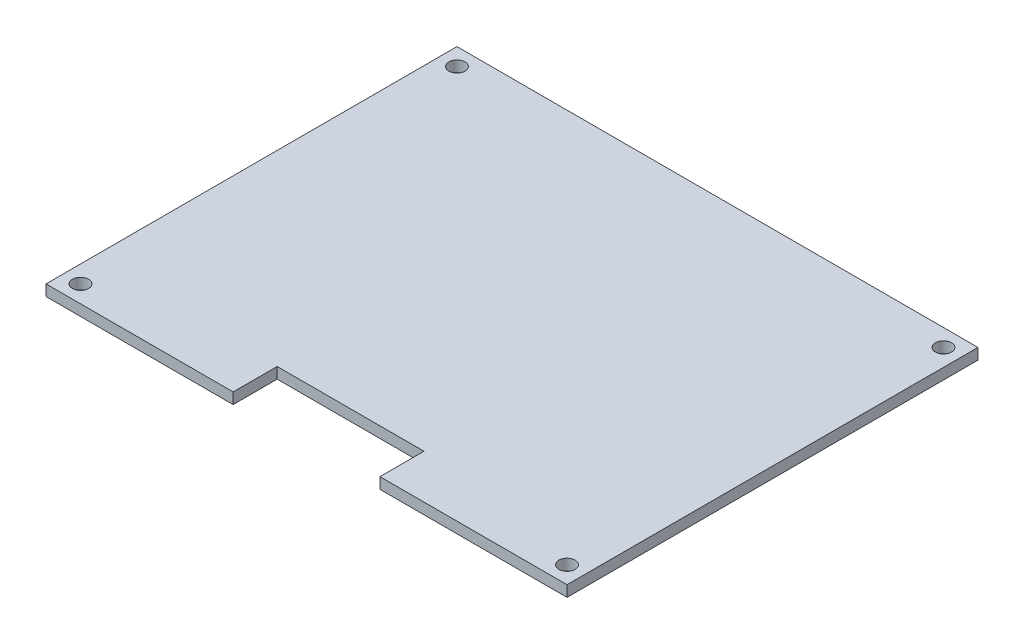
ISO-10303-21;
HEADER;
FILE_DESCRIPTION(('STEP AP214'),'2;1');
FILE_NAME('part.step','',(''),(''),'','','');
FILE_SCHEMA(('AUTOMOTIVE_DESIGN { 1 0 10303 214 1 1 1 1 }'));
ENDSEC;
DATA;
#1=APPLICATION_CONTEXT('core data for automotive mechanical design processes');
#2=APPLICATION_PROTOCOL_DEFINITION('international standard','automotive_design',2000,#1);
#3=PRODUCT_CONTEXT('',#1,'mechanical');
#4=PRODUCT('Part','Part','',(#3));
#5=PRODUCT_RELATED_PRODUCT_CATEGORY('part','',(#4));
#6=PRODUCT_DEFINITION_FORMATION('','',#4);
#7=PRODUCT_DEFINITION_CONTEXT('part definition',#1,'design');
#8=PRODUCT_DEFINITION('design','',#6,#7);
#9=PRODUCT_DEFINITION_SHAPE('','',#8);
#10=(LENGTH_UNIT() NAMED_UNIT(*) SI_UNIT(.MILLI.,.METRE.));
#11=(NAMED_UNIT(*) PLANE_ANGLE_UNIT() SI_UNIT($,.RADIAN.));
#12=(NAMED_UNIT(*) SI_UNIT($,.STERADIAN.) SOLID_ANGLE_UNIT());
#13=UNCERTAINTY_MEASURE_WITH_UNIT(LENGTH_MEASURE(1.E-05),#10,'distance_accuracy_value','');
#14=(GEOMETRIC_REPRESENTATION_CONTEXT(3) GLOBAL_UNCERTAINTY_ASSIGNED_CONTEXT((#13)) GLOBAL_UNIT_ASSIGNED_CONTEXT((#10,
#11,#12)) REPRESENTATION_CONTEXT('',''));
#15=CARTESIAN_POINT('',(0.,0.,0.));
#16=DIRECTION('',(0.,0.,1.));
#17=DIRECTION('',(1.,0.,0.));
#18=AXIS2_PLACEMENT_3D('',#15,#16,#17);
#19=CARTESIAN_POINT('',(0.,1.5,0.));
#20=DIRECTION('',(0.,0.,-1.));
#21=DIRECTION('',(-1.,0.,0.));
#22=AXIS2_PLACEMENT_3D('',#19,#20,#21);
#23=PLANE('',#22);
#24=DIRECTION('',(1.,0.,0.));
#25=VECTOR('',#24,1.);
#26=CARTESIAN_POINT('',(0.,1.5,0.));
#27=LINE('',#26,#25);
#28=CARTESIAN_POINT('',(45.5,1.5,0.));
#29=VERTEX_POINT('',#28);
#30=CARTESIAN_POINT('',(71.,1.5,0.));
#31=VERTEX_POINT('',#30);
#32=EDGE_CURVE('E129',#29,#31,#27,.T.);
#33=ORIENTED_EDGE('',*,*,#32,.F.);
#34=DIRECTION('',(0.,1.,0.));
#35=VECTOR('',#34,1.);
#36=CARTESIAN_POINT('',(45.5,-20.8806130178211,0.));
#37=LINE('',#36,#35);
#38=CARTESIAN_POINT('',(45.5,0.,0.));
#39=VERTEX_POINT('',#38);
#40=EDGE_CURVE('E117',#39,#29,#37,.T.);
#41=ORIENTED_EDGE('',*,*,#40,.F.);
#42=DIRECTION('',(1.,0.,0.));
#43=VECTOR('',#42,1.);
#44=CARTESIAN_POINT('',(0.,0.,0.));
#45=LINE('',#44,#43);
#46=CARTESIAN_POINT('',(71.,0.,0.));
#47=VERTEX_POINT('',#46);
#48=EDGE_CURVE('E127',#39,#47,#45,.T.);
#49=ORIENTED_EDGE('',*,*,#48,.T.);
#50=DIRECTION('',(0.,-1.,0.));
#51=VECTOR('',#50,1.);
#52=CARTESIAN_POINT('',(71.,1.5,0.));
#53=LINE('',#52,#51);
#54=EDGE_CURVE('E47',#31,#47,#53,.T.);
#55=ORIENTED_EDGE('',*,*,#54,.F.);
#56=EDGE_LOOP('',(#33,#41,#49,#55));
#57=FACE_BOUND('',#56,.T.);
#58=ADVANCED_FACE('F39',(#57),#23,.F.);
#59=CARTESIAN_POINT('',(0.,1.5,0.));
#60=DIRECTION('',(1.,0.,0.));
#61=DIRECTION('',(0.,0.,-1.));
#62=AXIS2_PLACEMENT_3D('',#59,#60,#61);
#63=PLANE('',#62);
#64=DIRECTION('',(0.,0.,1.));
#65=VECTOR('',#64,1.);
#66=CARTESIAN_POINT('',(0.,0.,0.));
#67=LINE('',#66,#65);
#68=CARTESIAN_POINT('',(0.,0.,-56.));
#69=VERTEX_POINT('',#68);
#70=CARTESIAN_POINT('',(0.,0.,0.));
#71=VERTEX_POINT('',#70);
#72=EDGE_CURVE('E136',#69,#71,#67,.T.);
#73=ORIENTED_EDGE('',*,*,#72,.T.);
#74=DIRECTION('',(0.,-1.,0.));
#75=VECTOR('',#74,1.);
#76=CARTESIAN_POINT('',(0.,1.5,0.));
#77=LINE('',#76,#75);
#78=CARTESIAN_POINT('',(0.,1.5,0.));
#79=VERTEX_POINT('',#78);
#80=EDGE_CURVE('E11',#79,#71,#77,.T.);
#81=ORIENTED_EDGE('',*,*,#80,.F.);
#82=DIRECTION('',(0.,0.,1.));
#83=VECTOR('',#82,1.);
#84=CARTESIAN_POINT('',(0.,1.5,0.));
#85=LINE('',#84,#83);
#86=CARTESIAN_POINT('',(0.,1.5,-56.));
#87=VERTEX_POINT('',#86);
#88=EDGE_CURVE('E145',#87,#79,#85,.T.);
#89=ORIENTED_EDGE('',*,*,#88,.F.);
#90=DIRECTION('',(0.,-1.,0.));
#91=VECTOR('',#90,1.);
#92=CARTESIAN_POINT('',(0.,1.5,-56.));
#93=LINE('',#92,#91);
#94=EDGE_CURVE('E146',#87,#69,#93,.T.);
#95=ORIENTED_EDGE('',*,*,#94,.T.);
#96=EDGE_LOOP('',(#73,#81,#89,#95));
#97=FACE_BOUND('',#96,.T.);
#98=ADVANCED_FACE('F41',(#97),#63,.F.);
#99=CARTESIAN_POINT('',(25.5,0.,0.));
#100=VERTEX_POINT('',#99);
#101=EDGE_CURVE('E135',#71,#100,#45,.T.);
#102=ORIENTED_EDGE('',*,*,#101,.T.);
#103=DIRECTION('',(0.,1.,0.));
#104=VECTOR('',#103,1.);
#105=CARTESIAN_POINT('',(25.5,-20.8806130178211,0.));
#106=LINE('',#105,#104);
#107=CARTESIAN_POINT('',(25.5,1.5,0.));
#108=VERTEX_POINT('',#107);
#109=EDGE_CURVE('E54',#100,#108,#106,.T.);
#110=ORIENTED_EDGE('',*,*,#109,.T.);
#111=EDGE_CURVE('E90',#79,#108,#27,.T.);
#112=ORIENTED_EDGE('',*,*,#111,.F.);
#113=ORIENTED_EDGE('',*,*,#80,.T.);
#114=EDGE_LOOP('',(#102,#110,#112,#113));
#115=FACE_BOUND('',#114,.T.);
#116=ADVANCED_FACE('F231',(#115),#23,.F.);
#117=CARTESIAN_POINT('',(71.,1.5,0.));
#118=DIRECTION('',(-1.,0.,0.));
#119=DIRECTION('',(0.,0.,1.));
#120=AXIS2_PLACEMENT_3D('',#117,#118,#119);
#121=PLANE('',#120);
#122=DIRECTION('',(0.,0.,-1.));
#123=VECTOR('',#122,1.);
#124=CARTESIAN_POINT('',(71.,0.,0.));
#125=LINE('',#124,#123);
#126=CARTESIAN_POINT('',(71.,0.,-56.));
#127=VERTEX_POINT('',#126);
#128=EDGE_CURVE('E134',#47,#127,#125,.T.);
#129=ORIENTED_EDGE('',*,*,#128,.T.);
#130=DIRECTION('',(0.,-1.,0.));
#131=VECTOR('',#130,1.);
#132=CARTESIAN_POINT('',(71.,1.5,-56.));
#133=LINE('',#132,#131);
#134=CARTESIAN_POINT('',(71.,1.5,-56.));
#135=VERTEX_POINT('',#134);
#136=EDGE_CURVE('E148',#135,#127,#133,.T.);
#137=ORIENTED_EDGE('',*,*,#136,.F.);
#138=DIRECTION('',(0.,0.,-1.));
#139=VECTOR('',#138,1.);
#140=CARTESIAN_POINT('',(71.,1.5,0.));
#141=LINE('',#140,#139);
#142=EDGE_CURVE('E153',#31,#135,#141,.T.);
#143=ORIENTED_EDGE('',*,*,#142,.F.);
#144=ORIENTED_EDGE('',*,*,#54,.T.);
#145=EDGE_LOOP('',(#129,#137,#143,#144));
#146=FACE_BOUND('',#145,.T.);
#147=ADVANCED_FACE('F151',(#146),#121,.F.);
#148=CARTESIAN_POINT('',(0.,1.5,-56.));
#149=DIRECTION('',(0.,0.,1.));
#150=DIRECTION('',(1.,0.,0.));
#151=AXIS2_PLACEMENT_3D('',#148,#149,#150);
#152=PLANE('',#151);
#153=DIRECTION('',(-1.,0.,0.));
#154=VECTOR('',#153,1.);
#155=CARTESIAN_POINT('',(0.,0.,-56.));
#156=LINE('',#155,#154);
#157=EDGE_CURVE('E84',#127,#69,#156,.T.);
#158=ORIENTED_EDGE('',*,*,#157,.T.);
#159=ORIENTED_EDGE('',*,*,#94,.F.);
#160=DIRECTION('',(-1.,0.,0.));
#161=VECTOR('',#160,1.);
#162=CARTESIAN_POINT('',(0.,1.5,-56.));
#163=LINE('',#162,#161);
#164=EDGE_CURVE('E63',#135,#87,#163,.T.);
#165=ORIENTED_EDGE('',*,*,#164,.F.);
#166=ORIENTED_EDGE('',*,*,#136,.T.);
#167=EDGE_LOOP('',(#158,#159,#165,#166));
#168=FACE_BOUND('',#167,.T.);
#169=ADVANCED_FACE('F243',(#168),#152,.F.);
#170=CARTESIAN_POINT('',(0.,1.5,0.));
#171=DIRECTION('',(0.,-1.,0.));
#172=DIRECTION('',(0.,0.,-1.));
#173=AXIS2_PLACEMENT_3D('',#170,#171,#172);
#174=PLANE('',#173);
#175=CARTESIAN_POINT('',(2.34999999999999,1.5,-2.35));
#176=DIRECTION('',(0.,-1.,0.));
#177=DIRECTION('',(0.,0.,-1.));
#178=AXIS2_PLACEMENT_3D('',#175,#176,#177);
#179=CIRCLE('',#178,1.09999999999999);
#180=CARTESIAN_POINT('',(2.34999999999999,1.5,-3.45));
#181=VERTEX_POINT('',#180);
#182=EDGE_CURVE('E188',#181,#181,#179,.T.);
#183=ORIENTED_EDGE('',*,*,#182,.T.);
#184=EDGE_LOOP('',(#183));
#185=FACE_BOUND('',#184,.T.);
#186=CARTESIAN_POINT('',(68.65,1.5,-2.35));
#187=DIRECTION('',(0.,-1.,0.));
#188=DIRECTION('',(0.,0.,-1.));
#189=AXIS2_PLACEMENT_3D('',#186,#187,#188);
#190=CIRCLE('',#189,1.10000000000001);
#191=CARTESIAN_POINT('',(68.65,1.5,-3.45000000000001));
#192=VERTEX_POINT('',#191);
#193=EDGE_CURVE('E189',#192,#192,#190,.T.);
#194=ORIENTED_EDGE('',*,*,#193,.T.);
#195=EDGE_LOOP('',(#194));
#196=FACE_BOUND('',#195,.T.);
#197=CARTESIAN_POINT('',(2.34999999999999,1.5,-53.65));
#198=DIRECTION('',(0.,1.,0.));
#199=DIRECTION('',(0.,0.,1.));
#200=AXIS2_PLACEMENT_3D('',#197,#198,#199);
#201=CIRCLE('',#200,1.09999999999999);
#202=CARTESIAN_POINT('',(2.34999999999999,1.5,-52.55));
#203=VERTEX_POINT('',#202);
#204=EDGE_CURVE('E176',#203,#203,#201,.T.);
#205=ORIENTED_EDGE('',*,*,#204,.F.);
#206=EDGE_LOOP('',(#205));
#207=FACE_BOUND('',#206,.T.);
#208=CARTESIAN_POINT('',(68.65,1.5,-53.65));
#209=DIRECTION('',(0.,1.,0.));
#210=DIRECTION('',(0.,0.,1.));
#211=AXIS2_PLACEMENT_3D('',#208,#209,#210);
#212=CIRCLE('',#211,1.10000000000001);
#213=CARTESIAN_POINT('',(68.65,1.5,-52.55));
#214=VERTEX_POINT('',#213);
#215=EDGE_CURVE('E173',#214,#214,#212,.T.);
#216=ORIENTED_EDGE('',*,*,#215,.F.);
#217=EDGE_LOOP('',(#216));
#218=FACE_BOUND('',#217,.T.);
#219=DIRECTION('',(-1.,0.,0.));
#220=VECTOR('',#219,1.);
#221=CARTESIAN_POINT('',(25.5,1.5,-6.));
#222=LINE('',#221,#220);
#223=CARTESIAN_POINT('',(45.5,1.5,-6.));
#224=VERTEX_POINT('',#223);
#225=CARTESIAN_POINT('',(25.5,1.5,-6.));
#226=VERTEX_POINT('',#225);
#227=EDGE_CURVE('E130',#224,#226,#222,.T.);
#228=ORIENTED_EDGE('',*,*,#227,.F.);
#229=DIRECTION('',(0.,0.,-1.));
#230=VECTOR('',#229,1.);
#231=CARTESIAN_POINT('',(45.5,1.5,-6.));
#232=LINE('',#231,#230);
#233=EDGE_CURVE('E168',#29,#224,#232,.T.);
#234=ORIENTED_EDGE('',*,*,#233,.F.);
#235=ORIENTED_EDGE('',*,*,#32,.T.);
#236=ORIENTED_EDGE('',*,*,#142,.T.);
#237=ORIENTED_EDGE('',*,*,#164,.T.);
#238=ORIENTED_EDGE('',*,*,#88,.T.);
#239=ORIENTED_EDGE('',*,*,#111,.T.);
#240=DIRECTION('',(0.,0.,1.));
#241=VECTOR('',#240,1.);
#242=CARTESIAN_POINT('',(25.5,1.5,-6.));
#243=LINE('',#242,#241);
#244=EDGE_CURVE('E166',#226,#108,#243,.T.);
#245=ORIENTED_EDGE('',*,*,#244,.F.);
#246=EDGE_LOOP('',(#228,#234,#235,#236,#237,#238,#239,#245));
#247=FACE_BOUND('',#246,.T.);
#248=ADVANCED_FACE('F197',(#185,#196,#207,#218,#247),#174,.F.);
#249=CARTESIAN_POINT('',(0.,0.,0.));
#250=DIRECTION('',(0.,-1.,0.));
#251=DIRECTION('',(0.,0.,-1.));
#252=AXIS2_PLACEMENT_3D('',#249,#250,#251);
#253=PLANE('',#252);
#254=CARTESIAN_POINT('',(2.34999999999999,0.,-2.35));
#255=DIRECTION('',(0.,-1.,0.));
#256=DIRECTION('',(0.,0.,-1.));
#257=AXIS2_PLACEMENT_3D('',#254,#255,#256);
#258=CIRCLE('',#257,1.09999999999999);
#259=CARTESIAN_POINT('',(2.34999999999999,0.,-3.45));
#260=VERTEX_POINT('',#259);
#261=EDGE_CURVE('E180',#260,#260,#258,.T.);
#262=ORIENTED_EDGE('',*,*,#261,.F.);
#263=EDGE_LOOP('',(#262));
#264=FACE_BOUND('',#263,.T.);
#265=CARTESIAN_POINT('',(68.65,0.,-2.35));
#266=DIRECTION('',(0.,-1.,0.));
#267=DIRECTION('',(0.,0.,-1.));
#268=AXIS2_PLACEMENT_3D('',#265,#266,#267);
#269=CIRCLE('',#268,1.10000000000001);
#270=CARTESIAN_POINT('',(68.65,0.,-3.45000000000001));
#271=VERTEX_POINT('',#270);
#272=EDGE_CURVE('E185',#271,#271,#269,.T.);
#273=ORIENTED_EDGE('',*,*,#272,.F.);
#274=EDGE_LOOP('',(#273));
#275=FACE_BOUND('',#274,.T.);
#276=CARTESIAN_POINT('',(2.34999999999999,0.,-53.65));
#277=DIRECTION('',(0.,-1.,0.));
#278=DIRECTION('',(0.,0.,-1.));
#279=AXIS2_PLACEMENT_3D('',#276,#277,#278);
#280=CIRCLE('',#279,1.09999999999999);
#281=CARTESIAN_POINT('',(2.34999999999999,0.,-54.75));
#282=VERTEX_POINT('',#281);
#283=EDGE_CURVE('E169',#282,#282,#280,.F.);
#284=ORIENTED_EDGE('',*,*,#283,.T.);
#285=EDGE_LOOP('',(#284));
#286=FACE_BOUND('',#285,.T.);
#287=CARTESIAN_POINT('',(68.65,0.,-53.65));
#288=DIRECTION('',(0.,-1.,0.));
#289=DIRECTION('',(0.,0.,-1.));
#290=AXIS2_PLACEMENT_3D('',#287,#288,#289);
#291=CIRCLE('',#290,1.10000000000001);
#292=CARTESIAN_POINT('',(68.65,0.,-54.75));
#293=VERTEX_POINT('',#292);
#294=EDGE_CURVE('E177',#293,#293,#291,.F.);
#295=ORIENTED_EDGE('',*,*,#294,.T.);
#296=EDGE_LOOP('',(#295));
#297=FACE_BOUND('',#296,.T.);
#298=DIRECTION('',(0.,0.,-1.));
#299=VECTOR('',#298,1.);
#300=CARTESIAN_POINT('',(45.5,0.,-6.));
#301=LINE('',#300,#299);
#302=CARTESIAN_POINT('',(45.5,0.,-6.));
#303=VERTEX_POINT('',#302);
#304=EDGE_CURVE('E113',#39,#303,#301,.T.);
#305=ORIENTED_EDGE('',*,*,#304,.T.);
#306=DIRECTION('',(-1.,0.,0.));
#307=VECTOR('',#306,1.);
#308=CARTESIAN_POINT('',(25.5,0.,-6.));
#309=LINE('',#308,#307);
#310=CARTESIAN_POINT('',(25.5,0.,-6.));
#311=VERTEX_POINT('',#310);
#312=EDGE_CURVE('E161',#303,#311,#309,.T.);
#313=ORIENTED_EDGE('',*,*,#312,.T.);
#314=DIRECTION('',(0.,0.,1.));
#315=VECTOR('',#314,1.);
#316=CARTESIAN_POINT('',(25.5,0.,-6.));
#317=LINE('',#316,#315);
#318=EDGE_CURVE('E158',#311,#100,#317,.T.);
#319=ORIENTED_EDGE('',*,*,#318,.T.);
#320=ORIENTED_EDGE('',*,*,#101,.F.);
#321=ORIENTED_EDGE('',*,*,#72,.F.);
#322=ORIENTED_EDGE('',*,*,#157,.F.);
#323=ORIENTED_EDGE('',*,*,#128,.F.);
#324=ORIENTED_EDGE('',*,*,#48,.F.);
#325=EDGE_LOOP('',(#305,#313,#319,#320,#321,#322,#323,#324));
#326=FACE_BOUND('',#325,.T.);
#327=ADVANCED_FACE('F133',(#264,#275,#286,#297,#326),#253,.T.);
#328=CARTESIAN_POINT('',(45.5,-20.8806130178211,-6.));
#329=DIRECTION('',(1.,0.,0.));
#330=DIRECTION('',(0.,0.,-1.));
#331=AXIS2_PLACEMENT_3D('',#328,#329,#330);
#332=PLANE('',#331);
#333=ORIENTED_EDGE('',*,*,#40,.T.);
#334=ORIENTED_EDGE('',*,*,#233,.T.);
#335=DIRECTION('',(0.,1.,0.));
#336=VECTOR('',#335,1.);
#337=CARTESIAN_POINT('',(45.5,-20.8806130178211,-6.));
#338=LINE('',#337,#336);
#339=EDGE_CURVE('E119',#303,#224,#338,.T.);
#340=ORIENTED_EDGE('',*,*,#339,.F.);
#341=ORIENTED_EDGE('',*,*,#304,.F.);
#342=EDGE_LOOP('',(#333,#334,#340,#341));
#343=FACE_BOUND('',#342,.T.);
#344=ADVANCED_FACE('F115',(#343),#332,.F.);
#345=CARTESIAN_POINT('',(25.5,-20.8806130178211,-6.));
#346=DIRECTION('',(0.,0.,-1.));
#347=DIRECTION('',(-1.,0.,0.));
#348=AXIS2_PLACEMENT_3D('',#345,#346,#347);
#349=PLANE('',#348);
#350=ORIENTED_EDGE('',*,*,#339,.T.);
#351=ORIENTED_EDGE('',*,*,#227,.T.);
#352=DIRECTION('',(0.,1.,0.));
#353=VECTOR('',#352,1.);
#354=CARTESIAN_POINT('',(25.5,-20.8806130178211,-6.));
#355=LINE('',#354,#353);
#356=EDGE_CURVE('E162',#311,#226,#355,.T.);
#357=ORIENTED_EDGE('',*,*,#356,.F.);
#358=ORIENTED_EDGE('',*,*,#312,.F.);
#359=EDGE_LOOP('',(#350,#351,#357,#358));
#360=FACE_BOUND('',#359,.T.);
#361=ADVANCED_FACE('F228',(#360),#349,.F.);
#362=CARTESIAN_POINT('',(25.5,-20.8806130178211,-6.));
#363=DIRECTION('',(-1.,0.,0.));
#364=DIRECTION('',(0.,0.,1.));
#365=AXIS2_PLACEMENT_3D('',#362,#363,#364);
#366=PLANE('',#365);
#367=ORIENTED_EDGE('',*,*,#356,.T.);
#368=ORIENTED_EDGE('',*,*,#244,.T.);
#369=ORIENTED_EDGE('',*,*,#109,.F.);
#370=ORIENTED_EDGE('',*,*,#318,.F.);
#371=EDGE_LOOP('',(#367,#368,#369,#370));
#372=FACE_BOUND('',#371,.T.);
#373=ADVANCED_FACE('F219',(#372),#366,.F.);
#374=CARTESIAN_POINT('',(68.65,-3.11126983722082,-53.65));
#375=DIRECTION('',(0.,1.,0.));
#376=DIRECTION('',(0.,0.,1.));
#377=AXIS2_PLACEMENT_3D('',#374,#375,#376);
#378=CYLINDRICAL_SURFACE('',#377,1.10000000000001);
#379=ORIENTED_EDGE('',*,*,#215,.T.);
#380=EDGE_LOOP('',(#379));
#381=FACE_BOUND('',#380,.T.);
#382=ORIENTED_EDGE('',*,*,#294,.F.);
#383=EDGE_LOOP('',(#382));
#384=FACE_BOUND('',#383,.T.);
#385=ADVANCED_FACE('F216',(#381,#384),#378,.F.);
#386=CARTESIAN_POINT('',(2.34999999999999,-3.11126983722082,-53.65));
#387=DIRECTION('',(0.,1.,0.));
#388=DIRECTION('',(0.,0.,1.));
#389=AXIS2_PLACEMENT_3D('',#386,#387,#388);
#390=CYLINDRICAL_SURFACE('',#389,1.09999999999999);
#391=ORIENTED_EDGE('',*,*,#204,.T.);
#392=EDGE_LOOP('',(#391));
#393=FACE_BOUND('',#392,.T.);
#394=ORIENTED_EDGE('',*,*,#283,.F.);
#395=EDGE_LOOP('',(#394));
#396=FACE_BOUND('',#395,.T.);
#397=ADVANCED_FACE('F218',(#393,#396),#390,.F.);
#398=CARTESIAN_POINT('',(68.65,-3.11126983722083,-2.35));
#399=DIRECTION('',(0.,1.,0.));
#400=DIRECTION('',(0.,0.,1.));
#401=AXIS2_PLACEMENT_3D('',#398,#399,#400);
#402=CYLINDRICAL_SURFACE('',#401,1.10000000000001);
#403=ORIENTED_EDGE('',*,*,#193,.F.);
#404=EDGE_LOOP('',(#403));
#405=FACE_BOUND('',#404,.T.);
#406=ORIENTED_EDGE('',*,*,#272,.T.);
#407=EDGE_LOOP('',(#406));
#408=FACE_BOUND('',#407,.T.);
#409=ADVANCED_FACE('F203',(#405,#408),#402,.F.);
#410=CARTESIAN_POINT('',(2.34999999999999,-3.11126983722083,-2.35));
#411=DIRECTION('',(0.,1.,0.));
#412=DIRECTION('',(0.,0.,1.));
#413=AXIS2_PLACEMENT_3D('',#410,#411,#412);
#414=CYLINDRICAL_SURFACE('',#413,1.09999999999999);
#415=ORIENTED_EDGE('',*,*,#182,.F.);
#416=EDGE_LOOP('',(#415));
#417=FACE_BOUND('',#416,.T.);
#418=ORIENTED_EDGE('',*,*,#261,.T.);
#419=EDGE_LOOP('',(#418));
#420=FACE_BOUND('',#419,.T.);
#421=ADVANCED_FACE('F200',(#417,#420),#414,.F.);
#422=CLOSED_SHELL('',(#58,#98,#116,#147,#169,#248,#327,#344,#361,#373,#385,#397,#409,#421));
#423=MANIFOLD_SOLID_BREP('B2',#422);
#424=ADVANCED_BREP_SHAPE_REPRESENTATION('',(#18,#423),#14);
#425=SHAPE_DEFINITION_REPRESENTATION(#9,#424);
ENDSEC;
END-ISO-10303-21;
